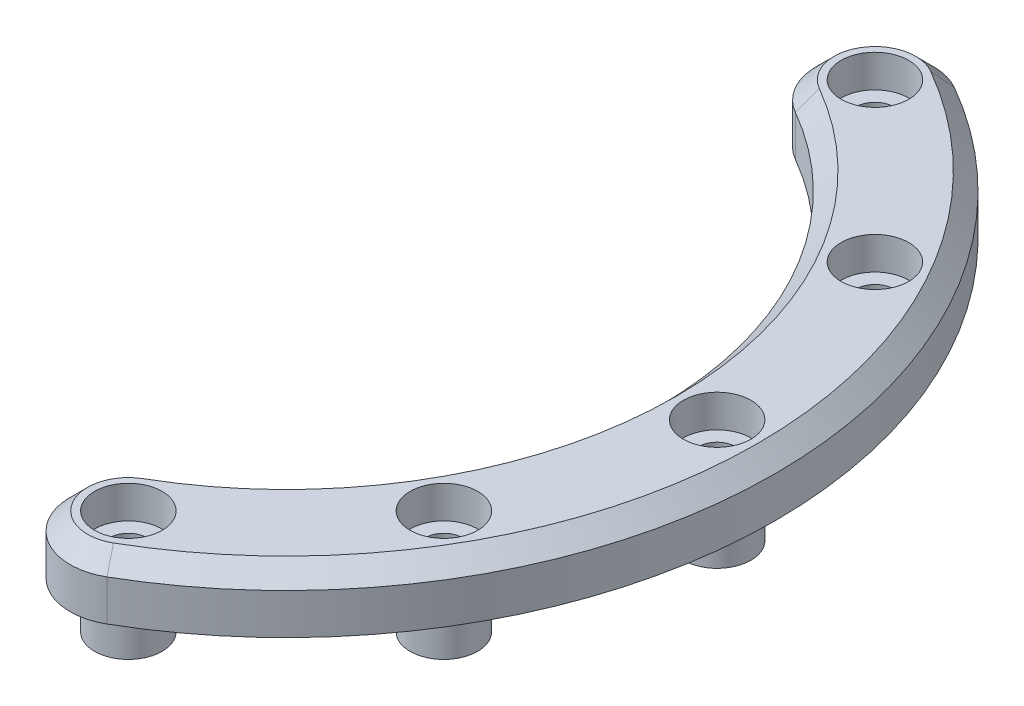
ISO-10303-21;
HEADER;
FILE_DESCRIPTION(('STEP AP214'),'2;1');
FILE_NAME('part.step','',(''),(''),'','','');
FILE_SCHEMA(('AUTOMOTIVE_DESIGN { 1 0 10303 214 1 1 1 1 }'));
ENDSEC;
DATA;
#1=APPLICATION_CONTEXT('core data for automotive mechanical design processes');
#2=APPLICATION_PROTOCOL_DEFINITION('international standard','automotive_design',2000,#1);
#3=PRODUCT_CONTEXT('',#1,'mechanical');
#4=PRODUCT('Part','Part','',(#3));
#5=PRODUCT_RELATED_PRODUCT_CATEGORY('part','',(#4));
#6=PRODUCT_DEFINITION_FORMATION('','',#4);
#7=PRODUCT_DEFINITION_CONTEXT('part definition',#1,'design');
#8=PRODUCT_DEFINITION('design','',#6,#7);
#9=PRODUCT_DEFINITION_SHAPE('','',#8);
#10=(LENGTH_UNIT() NAMED_UNIT(*) SI_UNIT(.MILLI.,.METRE.));
#11=(NAMED_UNIT(*) PLANE_ANGLE_UNIT() SI_UNIT($,.RADIAN.));
#12=(NAMED_UNIT(*) SI_UNIT($,.STERADIAN.) SOLID_ANGLE_UNIT());
#13=UNCERTAINTY_MEASURE_WITH_UNIT(LENGTH_MEASURE(1.E-05),#10,'distance_accuracy_value','');
#14=(GEOMETRIC_REPRESENTATION_CONTEXT(3) GLOBAL_UNCERTAINTY_ASSIGNED_CONTEXT((#13)) GLOBAL_UNIT_ASSIGNED_CONTEXT((#10,
#11,#12)) REPRESENTATION_CONTEXT('',''));
#15=CARTESIAN_POINT('',(0.,0.,0.));
#16=DIRECTION('',(0.,0.,1.));
#17=DIRECTION('',(1.,0.,0.));
#18=AXIS2_PLACEMENT_3D('',#15,#16,#17);
#19=CARTESIAN_POINT('',(18.4999999999999,-4.,-32.0429399400243));
#20=DIRECTION('',(0.,1.,0.));
#21=DIRECTION('',(0.,0.,1.));
#22=AXIS2_PLACEMENT_3D('',#19,#20,#21);
#23=CYLINDRICAL_SURFACE('',#22,1.6);
#24=CARTESIAN_POINT('',(18.4999999999999,-4.,-32.0429399400243));
#25=DIRECTION('',(0.,1.,0.));
#26=DIRECTION('',(0.,0.,1.));
#27=AXIS2_PLACEMENT_3D('',#24,#25,#26);
#28=CIRCLE('',#27,1.6);
#29=CARTESIAN_POINT('',(18.4999999999999,-4.,-30.4429399400243));
#30=VERTEX_POINT('',#29);
#31=EDGE_CURVE('E214',#30,#30,#28,.T.);
#32=ORIENTED_EDGE('',*,*,#31,.F.);
#33=EDGE_LOOP('',(#32));
#34=FACE_BOUND('',#33,.T.);
#35=CARTESIAN_POINT('',(18.4999999999999,2.2,-32.0429399400243));
#36=DIRECTION('',(0.,1.,0.));
#37=DIRECTION('',(0.,0.,1.));
#38=AXIS2_PLACEMENT_3D('',#35,#36,#37);
#39=CIRCLE('',#38,1.6);
#40=CARTESIAN_POINT('',(18.4999999999999,2.2,-30.4429399400243));
#41=VERTEX_POINT('',#40);
#42=EDGE_CURVE('E161',#41,#41,#39,.F.);
#43=ORIENTED_EDGE('',*,*,#42,.F.);
#44=EDGE_LOOP('',(#43));
#45=FACE_BOUND('',#44,.T.);
#46=ADVANCED_FACE('F41',(#34,#45),#23,.F.);
#47=CARTESIAN_POINT('',(32.0429399400251,-4.,-18.5000000000006));
#48=DIRECTION('',(0.,1.,0.));
#49=DIRECTION('',(0.,0.,1.));
#50=AXIS2_PLACEMENT_3D('',#47,#48,#49);
#51=CYLINDRICAL_SURFACE('',#50,1.59999999999923);
#52=CARTESIAN_POINT('',(32.0429399400251,-4.,-18.5000000000006));
#53=DIRECTION('',(0.,1.,0.));
#54=DIRECTION('',(0.,0.,1.));
#55=AXIS2_PLACEMENT_3D('',#52,#53,#54);
#56=CIRCLE('',#55,1.59999999999923);
#57=CARTESIAN_POINT('',(32.0429399400251,-4.,-16.9000000000013));
#58=VERTEX_POINT('',#57);
#59=EDGE_CURVE('E219',#58,#58,#56,.T.);
#60=ORIENTED_EDGE('',*,*,#59,.F.);
#61=EDGE_LOOP('',(#60));
#62=FACE_BOUND('',#61,.T.);
#63=CARTESIAN_POINT('',(32.0429399400251,2.2,-18.5000000000006));
#64=DIRECTION('',(0.,1.,0.));
#65=DIRECTION('',(0.,0.,1.));
#66=AXIS2_PLACEMENT_3D('',#63,#64,#65);
#67=CIRCLE('',#66,1.59999999999923);
#68=CARTESIAN_POINT('',(32.0429399400251,2.2,-16.9000000000013));
#69=VERTEX_POINT('',#68);
#70=EDGE_CURVE('E157',#69,#69,#67,.F.);
#71=ORIENTED_EDGE('',*,*,#70,.F.);
#72=EDGE_LOOP('',(#71));
#73=FACE_BOUND('',#72,.T.);
#74=ADVANCED_FACE('F290',(#62,#73),#51,.F.);
#75=CARTESIAN_POINT('',(37.0000000000018,-4.,-5.07230491538268E-13));
#76=DIRECTION('',(0.,1.,0.));
#77=DIRECTION('',(0.,0.,1.));
#78=AXIS2_PLACEMENT_3D('',#75,#76,#77);
#79=CYLINDRICAL_SURFACE('',#78,1.59999999999902);
#80=CARTESIAN_POINT('',(37.0000000000018,-4.,-5.07230491538268E-13));
#81=DIRECTION('',(0.,1.,0.));
#82=DIRECTION('',(0.,0.,1.));
#83=AXIS2_PLACEMENT_3D('',#80,#81,#82);
#84=CIRCLE('',#83,1.59999999999902);
#85=CARTESIAN_POINT('',(37.0000000000018,-4.,1.59999999999851));
#86=VERTEX_POINT('',#85);
#87=EDGE_CURVE('E223',#86,#86,#84,.T.);
#88=ORIENTED_EDGE('',*,*,#87,.F.);
#89=EDGE_LOOP('',(#88));
#90=FACE_BOUND('',#89,.T.);
#91=CARTESIAN_POINT('',(37.0000000000018,2.2,-5.07230491538268E-13));
#92=DIRECTION('',(0.,1.,0.));
#93=DIRECTION('',(0.,0.,1.));
#94=AXIS2_PLACEMENT_3D('',#91,#92,#93);
#95=CIRCLE('',#94,1.59999999999902);
#96=CARTESIAN_POINT('',(37.0000000000018,2.2,1.59999999999851));
#97=VERTEX_POINT('',#96);
#98=EDGE_CURVE('E153',#97,#97,#95,.F.);
#99=ORIENTED_EDGE('',*,*,#98,.F.);
#100=EDGE_LOOP('',(#99));
#101=FACE_BOUND('',#100,.T.);
#102=ADVANCED_FACE('F296',(#90,#101),#79,.F.);
#103=CARTESIAN_POINT('',(32.0429399400267,-4.,18.5));
#104=DIRECTION('',(0.,1.,0.));
#105=DIRECTION('',(0.,0.,1.));
#106=AXIS2_PLACEMENT_3D('',#103,#104,#105);
#107=CYLINDRICAL_SURFACE('',#106,1.59999999999934);
#108=CARTESIAN_POINT('',(32.0429399400267,-4.,18.5));
#109=DIRECTION('',(0.,1.,0.));
#110=DIRECTION('',(0.,0.,1.));
#111=AXIS2_PLACEMENT_3D('',#108,#109,#110);
#112=CIRCLE('',#111,1.59999999999934);
#113=CARTESIAN_POINT('',(32.0429399400267,-4.,20.0999999999993));
#114=VERTEX_POINT('',#113);
#115=EDGE_CURVE('E227',#114,#114,#112,.T.);
#116=ORIENTED_EDGE('',*,*,#115,.F.);
#117=EDGE_LOOP('',(#116));
#118=FACE_BOUND('',#117,.T.);
#119=CARTESIAN_POINT('',(32.0429399400267,2.2,18.5));
#120=DIRECTION('',(0.,1.,0.));
#121=DIRECTION('',(0.,0.,1.));
#122=AXIS2_PLACEMENT_3D('',#119,#120,#121);
#123=CIRCLE('',#122,1.59999999999934);
#124=CARTESIAN_POINT('',(32.0429399400267,2.2,20.0999999999993));
#125=VERTEX_POINT('',#124);
#126=EDGE_CURVE('E148',#125,#125,#123,.F.);
#127=ORIENTED_EDGE('',*,*,#126,.F.);
#128=EDGE_LOOP('',(#127));
#129=FACE_BOUND('',#128,.T.);
#130=ADVANCED_FACE('F307',(#118,#129),#107,.F.);
#131=CARTESIAN_POINT('',(18.5000000000026,-4.,32.0429399400248));
#132=DIRECTION('',(0.,1.,0.));
#133=DIRECTION('',(0.,0.,1.));
#134=AXIS2_PLACEMENT_3D('',#131,#132,#133);
#135=CYLINDRICAL_SURFACE('',#134,1.60000000000008);
#136=CARTESIAN_POINT('',(18.5000000000026,-4.,32.0429399400248));
#137=DIRECTION('',(0.,1.,0.));
#138=DIRECTION('',(0.,0.,1.));
#139=AXIS2_PLACEMENT_3D('',#136,#137,#138);
#140=CIRCLE('',#139,1.60000000000008);
#141=CARTESIAN_POINT('',(18.5000000000026,-4.,33.6429399400249));
#142=VERTEX_POINT('',#141);
#143=EDGE_CURVE('E165',#142,#142,#140,.T.);
#144=ORIENTED_EDGE('',*,*,#143,.F.);
#145=EDGE_LOOP('',(#144));
#146=FACE_BOUND('',#145,.T.);
#147=CARTESIAN_POINT('',(18.5000000000026,2.2,32.0429399400248));
#148=DIRECTION('',(0.,1.,0.));
#149=DIRECTION('',(0.,0.,1.));
#150=AXIS2_PLACEMENT_3D('',#147,#148,#149);
#151=CIRCLE('',#150,1.60000000000008);
#152=CARTESIAN_POINT('',(18.5000000000026,2.2,33.6429399400249));
#153=VERTEX_POINT('',#152);
#154=EDGE_CURVE('E144',#153,#153,#151,.F.);
#155=ORIENTED_EDGE('',*,*,#154,.F.);
#156=EDGE_LOOP('',(#155));
#157=FACE_BOUND('',#156,.T.);
#158=ADVANCED_FACE('F311',(#146,#157),#135,.F.);
#159=CARTESIAN_POINT('',(0.,5.,0.));
#160=DIRECTION('',(0.,-1.,0.));
#161=DIRECTION('',(0.,0.,-1.));
#162=AXIS2_PLACEMENT_3D('',#159,#160,#161);
#163=CYLINDRICAL_SURFACE('',#162,32.);
#164=DIRECTION('',(0.,-1.,0.));
#165=VECTOR('',#164,1.);
#166=CARTESIAN_POINT('',(15.9999999999999,5.,27.7128129211021));
#167=LINE('',#166,#165);
#168=CARTESIAN_POINT('',(15.9999999999999,3.49999999999999,27.7128129211021));
#169=VERTEX_POINT('',#168);
#170=CARTESIAN_POINT('',(15.9999999999999,0.,27.7128129211021));
#171=VERTEX_POINT('',#170);
#172=EDGE_CURVE('E96',#169,#171,#167,.T.);
#173=ORIENTED_EDGE('',*,*,#172,.F.);
#174=CARTESIAN_POINT('',(0.,3.49999999999999,0.));
#175=DIRECTION('',(0.,-1.,0.));
#176=DIRECTION('',(0.,0.,-1.));
#177=AXIS2_PLACEMENT_3D('',#174,#175,#176);
#178=CIRCLE('',#177,32.);
#179=CARTESIAN_POINT('',(15.9999999999999,3.49999999999999,-27.7128129211021));
#180=VERTEX_POINT('',#179);
#181=EDGE_CURVE('E178',#169,#180,#178,.F.);
#182=ORIENTED_EDGE('',*,*,#181,.T.);
#183=DIRECTION('',(0.,-1.,0.));
#184=VECTOR('',#183,1.);
#185=CARTESIAN_POINT('',(15.9999999999999,5.,-27.7128129211021));
#186=LINE('',#185,#184);
#187=CARTESIAN_POINT('',(15.9999999999999,0.,-27.7128129211021));
#188=VERTEX_POINT('',#187);
#189=EDGE_CURVE('E121',#180,#188,#186,.T.);
#190=ORIENTED_EDGE('',*,*,#189,.T.);
#191=CARTESIAN_POINT('',(0.,0.,0.));
#192=DIRECTION('',(0.,-1.,0.));
#193=DIRECTION('',(0.,0.,-1.));
#194=AXIS2_PLACEMENT_3D('',#191,#192,#193);
#195=CIRCLE('',#194,32.);
#196=EDGE_CURVE('E115',#188,#171,#195,.T.);
#197=ORIENTED_EDGE('',*,*,#196,.T.);
#198=EDGE_LOOP('',(#173,#182,#190,#197));
#199=FACE_BOUND('',#198,.T.);
#200=ADVANCED_FACE('F120',(#199),#163,.F.);
#201=CARTESIAN_POINT('',(18.4999999999999,5.,32.0429399400243));
#202=DIRECTION('',(0.,-1.,0.));
#203=DIRECTION('',(0.,0.,-1.));
#204=AXIS2_PLACEMENT_3D('',#201,#202,#203);
#205=CYLINDRICAL_SURFACE('',#204,5.);
#206=DIRECTION('',(0.,-1.,0.));
#207=VECTOR('',#206,1.);
#208=CARTESIAN_POINT('',(20.9999999999999,5.,36.3730669589465));
#209=LINE('',#208,#207);
#210=CARTESIAN_POINT('',(20.9999999999999,3.49999999999999,36.3730669589465));
#211=VERTEX_POINT('',#210);
#212=CARTESIAN_POINT('',(20.9999999999999,0.,36.3730669589465));
#213=VERTEX_POINT('',#212);
#214=EDGE_CURVE('E109',#211,#213,#209,.T.);
#215=ORIENTED_EDGE('',*,*,#214,.F.);
#216=CARTESIAN_POINT('',(18.4999999999999,3.49999999999999,32.0429399400243));
#217=DIRECTION('',(0.,-1.,0.));
#218=DIRECTION('',(0.,0.,-1.));
#219=AXIS2_PLACEMENT_3D('',#216,#217,#218);
#220=CIRCLE('',#219,5.);
#221=EDGE_CURVE('E102',#211,#169,#220,.T.);
#222=ORIENTED_EDGE('',*,*,#221,.T.);
#223=ORIENTED_EDGE('',*,*,#172,.T.);
#224=CARTESIAN_POINT('',(18.4999999999999,0.,32.0429399400243));
#225=DIRECTION('',(0.,1.,0.));
#226=DIRECTION('',(0.,0.,-1.));
#227=AXIS2_PLACEMENT_3D('',#224,#225,#226);
#228=CIRCLE('',#227,5.);
#229=EDGE_CURVE('E99',#171,#213,#228,.T.);
#230=ORIENTED_EDGE('',*,*,#229,.T.);
#231=EDGE_LOOP('',(#215,#222,#223,#230));
#232=FACE_BOUND('',#231,.T.);
#233=ADVANCED_FACE('F98',(#232),#205,.T.);
#234=CARTESIAN_POINT('',(0.,5.,0.));
#235=DIRECTION('',(0.,-1.,0.));
#236=DIRECTION('',(0.,0.,-1.));
#237=AXIS2_PLACEMENT_3D('',#234,#235,#236);
#238=CYLINDRICAL_SURFACE('',#237,42.);
#239=DIRECTION('',(0.,-1.,0.));
#240=VECTOR('',#239,1.);
#241=CARTESIAN_POINT('',(20.9999999999999,5.,-36.3730669589465));
#242=LINE('',#241,#240);
#243=CARTESIAN_POINT('',(20.9999999999999,3.49999999999999,-36.3730669589465));
#244=VERTEX_POINT('',#243);
#245=CARTESIAN_POINT('',(20.9999999999999,0.,-36.3730669589465));
#246=VERTEX_POINT('',#245);
#247=EDGE_CURVE('E139',#244,#246,#242,.T.);
#248=ORIENTED_EDGE('',*,*,#247,.F.);
#249=CARTESIAN_POINT('',(0.,3.49999999999999,0.));
#250=DIRECTION('',(0.,-1.,0.));
#251=DIRECTION('',(0.,0.,-1.));
#252=AXIS2_PLACEMENT_3D('',#249,#250,#251);
#253=CIRCLE('',#252,42.);
#254=EDGE_CURVE('E11',#244,#211,#253,.T.);
#255=ORIENTED_EDGE('',*,*,#254,.T.);
#256=ORIENTED_EDGE('',*,*,#214,.T.);
#257=CARTESIAN_POINT('',(0.,0.,0.));
#258=DIRECTION('',(0.,1.,0.));
#259=DIRECTION('',(0.,0.,-1.));
#260=AXIS2_PLACEMENT_3D('',#257,#258,#259);
#261=CIRCLE('',#260,42.);
#262=EDGE_CURVE('E117',#213,#246,#261,.T.);
#263=ORIENTED_EDGE('',*,*,#262,.T.);
#264=EDGE_LOOP('',(#248,#255,#256,#263));
#265=FACE_BOUND('',#264,.T.);
#266=ADVANCED_FACE('F582',(#265),#238,.T.);
#267=CARTESIAN_POINT('',(18.4999999999999,5.,-32.0429399400243));
#268=DIRECTION('',(0.,-1.,0.));
#269=DIRECTION('',(0.,0.,-1.));
#270=AXIS2_PLACEMENT_3D('',#267,#268,#269);
#271=CYLINDRICAL_SURFACE('',#270,5.);
#272=ORIENTED_EDGE('',*,*,#189,.F.);
#273=CARTESIAN_POINT('',(18.4999999999999,3.49999999999999,-32.0429399400243));
#274=DIRECTION('',(0.,-1.,0.));
#275=DIRECTION('',(0.,0.,-1.));
#276=AXIS2_PLACEMENT_3D('',#273,#274,#275);
#277=CIRCLE('',#276,5.);
#278=EDGE_CURVE('E52',#180,#244,#277,.T.);
#279=ORIENTED_EDGE('',*,*,#278,.T.);
#280=ORIENTED_EDGE('',*,*,#247,.T.);
#281=CARTESIAN_POINT('',(18.4999999999999,0.,-32.0429399400243));
#282=DIRECTION('',(0.,1.,0.));
#283=DIRECTION('',(0.,0.,1.));
#284=AXIS2_PLACEMENT_3D('',#281,#282,#283);
#285=CIRCLE('',#284,5.);
#286=EDGE_CURVE('E134',#246,#188,#285,.T.);
#287=ORIENTED_EDGE('',*,*,#286,.T.);
#288=EDGE_LOOP('',(#272,#279,#280,#287));
#289=FACE_BOUND('',#288,.T.);
#290=ADVANCED_FACE('F574',(#289),#271,.T.);
#291=CARTESIAN_POINT('',(9.24999999999996,5.,16.0214699700121));
#292=DIRECTION('',(0.,-1.,0.));
#293=DIRECTION('',(0.,0.,-1.));
#294=AXIS2_PLACEMENT_3D('',#291,#292,#293);
#295=PLANE('',#294);
#296=CARTESIAN_POINT('',(18.4999999999999,5.,-32.0429399400243));
#297=DIRECTION('',(0.,-1.,0.));
#298=DIRECTION('',(0.,0.,-1.));
#299=AXIS2_PLACEMENT_3D('',#296,#297,#298);
#300=CIRCLE('',#299,3.5);
#301=CARTESIAN_POINT('',(20.2499999999999,5.,-35.0740288532698));
#302=VERTEX_POINT('',#301);
#303=CARTESIAN_POINT('',(16.7499999999999,5.,-29.0118510267787));
#304=VERTEX_POINT('',#303);
#305=EDGE_CURVE('E168',#302,#304,#300,.F.);
#306=ORIENTED_EDGE('',*,*,#305,.T.);
#307=CARTESIAN_POINT('',(0.,5.,0.));
#308=DIRECTION('',(0.,-1.,0.));
#309=DIRECTION('',(0.,0.,-1.));
#310=AXIS2_PLACEMENT_3D('',#307,#308,#309);
#311=CIRCLE('',#310,33.5);
#312=CARTESIAN_POINT('',(16.7499999999999,5.,29.0118510267787));
#313=VERTEX_POINT('',#312);
#314=EDGE_CURVE('E174',#304,#313,#311,.T.);
#315=ORIENTED_EDGE('',*,*,#314,.T.);
#316=CARTESIAN_POINT('',(18.4999999999999,5.,32.0429399400243));
#317=DIRECTION('',(0.,-1.,0.));
#318=DIRECTION('',(0.,0.,-1.));
#319=AXIS2_PLACEMENT_3D('',#316,#317,#318);
#320=CIRCLE('',#319,3.5);
#321=CARTESIAN_POINT('',(20.2499999999999,5.,35.0740288532698));
#322=VERTEX_POINT('',#321);
#323=EDGE_CURVE('E171',#313,#322,#320,.F.);
#324=ORIENTED_EDGE('',*,*,#323,.T.);
#325=CARTESIAN_POINT('',(0.,5.,0.));
#326=DIRECTION('',(0.,-1.,0.));
#327=DIRECTION('',(0.,0.,-1.));
#328=AXIS2_PLACEMENT_3D('',#325,#326,#327);
#329=CIRCLE('',#328,40.5);
#330=EDGE_CURVE('E108',#322,#302,#329,.F.);
#331=ORIENTED_EDGE('',*,*,#330,.T.);
#332=EDGE_LOOP('',(#306,#315,#324,#331));
#333=FACE_BOUND('',#332,.T.);
#334=CARTESIAN_POINT('',(18.4999999999999,5.,-32.0429399400243));
#335=DIRECTION('',(0.,1.,0.));
#336=DIRECTION('',(0.,0.,1.));
#337=AXIS2_PLACEMENT_3D('',#334,#335,#336);
#338=CIRCLE('',#337,2.9);
#339=CARTESIAN_POINT('',(18.4999999999999,5.,-29.1429399400243));
#340=VERTEX_POINT('',#339);
#341=EDGE_CURVE('E633',#340,#340,#338,.T.);
#342=ORIENTED_EDGE('',*,*,#341,.F.);
#343=EDGE_LOOP('',(#342));
#344=FACE_BOUND('',#343,.T.);
#345=CARTESIAN_POINT('',(32.0429399400251,5.,-18.5000000000006));
#346=DIRECTION('',(0.,1.,0.));
#347=DIRECTION('',(0.,0.,1.));
#348=AXIS2_PLACEMENT_3D('',#345,#346,#347);
#349=CIRCLE('',#348,2.89999999999923);
#350=CARTESIAN_POINT('',(32.0429399400251,5.,-15.6000000000013));
#351=VERTEX_POINT('',#350);
#352=EDGE_CURVE('E637',#351,#351,#349,.T.);
#353=ORIENTED_EDGE('',*,*,#352,.F.);
#354=EDGE_LOOP('',(#353));
#355=FACE_BOUND('',#354,.T.);
#356=CARTESIAN_POINT('',(37.0000000000018,5.,-5.07230491538268E-13));
#357=DIRECTION('',(0.,1.,0.));
#358=DIRECTION('',(0.,0.,1.));
#359=AXIS2_PLACEMENT_3D('',#356,#357,#358);
#360=CIRCLE('',#359,2.89999999999902);
#361=CARTESIAN_POINT('',(37.0000000000018,5.,2.89999999999851));
#362=VERTEX_POINT('',#361);
#363=EDGE_CURVE('E641',#362,#362,#360,.T.);
#364=ORIENTED_EDGE('',*,*,#363,.F.);
#365=EDGE_LOOP('',(#364));
#366=FACE_BOUND('',#365,.T.);
#367=CARTESIAN_POINT('',(32.0429399400267,5.,18.5));
#368=DIRECTION('',(0.,1.,0.));
#369=DIRECTION('',(0.,0.,1.));
#370=AXIS2_PLACEMENT_3D('',#367,#368,#369);
#371=CIRCLE('',#370,2.89999999999934);
#372=CARTESIAN_POINT('',(32.0429399400267,5.,21.3999999999993));
#373=VERTEX_POINT('',#372);
#374=EDGE_CURVE('E210',#373,#373,#371,.T.);
#375=ORIENTED_EDGE('',*,*,#374,.F.);
#376=EDGE_LOOP('',(#375));
#377=FACE_BOUND('',#376,.T.);
#378=CARTESIAN_POINT('',(18.5000000000026,5.,32.0429399400248));
#379=DIRECTION('',(0.,1.,0.));
#380=DIRECTION('',(0.,0.,1.));
#381=AXIS2_PLACEMENT_3D('',#378,#379,#380);
#382=CIRCLE('',#381,2.90000000000008);
#383=CARTESIAN_POINT('',(18.5000000000026,5.,34.9429399400249));
#384=VERTEX_POINT('',#383);
#385=EDGE_CURVE('E198',#384,#384,#382,.T.);
#386=ORIENTED_EDGE('',*,*,#385,.F.);
#387=EDGE_LOOP('',(#386));
#388=FACE_BOUND('',#387,.T.);
#389=ADVANCED_FACE('F271',(#333,#344,#355,#366,#377,#388),#295,.F.);
#390=CARTESIAN_POINT('',(9.24999999999996,0.,16.0214699700121));
#391=DIRECTION('',(0.,-1.,0.));
#392=DIRECTION('',(0.,0.,-1.));
#393=AXIS2_PLACEMENT_3D('',#390,#391,#392);
#394=PLANE('',#393);
#395=CARTESIAN_POINT('',(18.5000000000026,0.,-32.0429399400248));
#396=DIRECTION('',(0.,-1.,0.));
#397=DIRECTION('',(0.,0.,-1.));
#398=AXIS2_PLACEMENT_3D('',#395,#396,#397);
#399=CIRCLE('',#398,2.9);
#400=CARTESIAN_POINT('',(18.5000000000026,0.,-34.9429399400248));
#401=VERTEX_POINT('',#400);
#402=EDGE_CURVE('E218',#401,#401,#399,.T.);
#403=ORIENTED_EDGE('',*,*,#402,.F.);
#404=EDGE_LOOP('',(#403));
#405=FACE_BOUND('',#404,.T.);
#406=CARTESIAN_POINT('',(32.0429399400267,0.,-18.5));
#407=DIRECTION('',(0.,-1.,0.));
#408=DIRECTION('',(0.,0.,-1.));
#409=AXIS2_PLACEMENT_3D('',#406,#407,#408);
#410=CIRCLE('',#409,2.9);
#411=CARTESIAN_POINT('',(32.0429399400267,0.,-21.4));
#412=VERTEX_POINT('',#411);
#413=EDGE_CURVE('E238',#412,#412,#410,.T.);
#414=ORIENTED_EDGE('',*,*,#413,.F.);
#415=EDGE_LOOP('',(#414));
#416=FACE_BOUND('',#415,.T.);
#417=CARTESIAN_POINT('',(37.0000000000018,0.,5.07230491538268E-13));
#418=DIRECTION('',(0.,-1.,0.));
#419=DIRECTION('',(0.,0.,-1.));
#420=AXIS2_PLACEMENT_3D('',#417,#418,#419);
#421=CIRCLE('',#420,2.9);
#422=CARTESIAN_POINT('',(37.0000000000018,0.,-2.89999999999949));
#423=VERTEX_POINT('',#422);
#424=EDGE_CURVE('E246',#423,#423,#421,.T.);
#425=ORIENTED_EDGE('',*,*,#424,.F.);
#426=EDGE_LOOP('',(#425));
#427=FACE_BOUND('',#426,.T.);
#428=CARTESIAN_POINT('',(32.0429399400251,0.,18.5000000000006));
#429=DIRECTION('',(0.,-1.,0.));
#430=DIRECTION('',(0.,0.,-1.));
#431=AXIS2_PLACEMENT_3D('',#428,#429,#430);
#432=CIRCLE('',#431,2.9);
#433=CARTESIAN_POINT('',(32.0429399400251,0.,15.6000000000006));
#434=VERTEX_POINT('',#433);
#435=EDGE_CURVE('E254',#434,#434,#432,.T.);
#436=ORIENTED_EDGE('',*,*,#435,.F.);
#437=EDGE_LOOP('',(#436));
#438=FACE_BOUND('',#437,.T.);
#439=CARTESIAN_POINT('',(18.4999999999999,0.,32.0429399400243));
#440=DIRECTION('',(0.,-1.,0.));
#441=DIRECTION('',(0.,0.,-1.));
#442=AXIS2_PLACEMENT_3D('',#439,#440,#441);
#443=CIRCLE('',#442,2.9);
#444=CARTESIAN_POINT('',(18.4999999999999,0.,29.1429399400243));
#445=VERTEX_POINT('',#444);
#446=EDGE_CURVE('E128',#445,#445,#443,.T.);
#447=ORIENTED_EDGE('',*,*,#446,.F.);
#448=EDGE_LOOP('',(#447));
#449=FACE_BOUND('',#448,.T.);
#450=ORIENTED_EDGE('',*,*,#196,.F.);
#451=ORIENTED_EDGE('',*,*,#286,.F.);
#452=ORIENTED_EDGE('',*,*,#262,.F.);
#453=ORIENTED_EDGE('',*,*,#229,.F.);
#454=EDGE_LOOP('',(#450,#451,#452,#453));
#455=FACE_BOUND('',#454,.T.);
#456=ADVANCED_FACE('F113',(#405,#416,#427,#438,#449,#455),#394,.T.);
#457=CARTESIAN_POINT('',(18.4999999999999,-4.,32.0429399400243));
#458=DIRECTION('',(0.,1.,0.));
#459=DIRECTION('',(0.,0.,1.));
#460=AXIS2_PLACEMENT_3D('',#457,#458,#459);
#461=CYLINDRICAL_SURFACE('',#460,2.9);
#462=CARTESIAN_POINT('',(18.4999999999999,-4.,32.0429399400243));
#463=DIRECTION('',(0.,-1.,0.));
#464=DIRECTION('',(0.,0.,-1.));
#465=AXIS2_PLACEMENT_3D('',#462,#463,#464);
#466=CIRCLE('',#465,2.9);
#467=CARTESIAN_POINT('',(18.4999999999999,-4.,29.1429399400243));
#468=VERTEX_POINT('',#467);
#469=EDGE_CURVE('E124',#468,#468,#466,.T.);
#470=ORIENTED_EDGE('',*,*,#469,.F.);
#471=EDGE_LOOP('',(#470));
#472=FACE_BOUND('',#471,.T.);
#473=ORIENTED_EDGE('',*,*,#446,.T.);
#474=EDGE_LOOP('',(#473));
#475=FACE_BOUND('',#474,.T.);
#476=ADVANCED_FACE('F270',(#472,#475),#461,.T.);
#477=CARTESIAN_POINT('',(18.4999999999999,-4.,32.0429399400243));
#478=DIRECTION('',(0.,-1.,0.));
#479=DIRECTION('',(0.,0.,-1.));
#480=AXIS2_PLACEMENT_3D('',#477,#478,#479);
#481=PLANE('',#480);
#482=ORIENTED_EDGE('',*,*,#143,.T.);
#483=EDGE_LOOP('',(#482));
#484=FACE_BOUND('',#483,.T.);
#485=ORIENTED_EDGE('',*,*,#469,.T.);
#486=EDGE_LOOP('',(#485));
#487=FACE_BOUND('',#486,.T.);
#488=ADVANCED_FACE('F279',(#484,#487),#481,.T.);
#489=CARTESIAN_POINT('',(32.0429399400251,-4.,18.5000000000006));
#490=DIRECTION('',(0.,1.,0.));
#491=DIRECTION('',(0.,0.,1.));
#492=AXIS2_PLACEMENT_3D('',#489,#490,#491);
#493=CYLINDRICAL_SURFACE('',#492,2.9);
#494=CARTESIAN_POINT('',(32.0429399400251,-4.,18.5000000000006));
#495=DIRECTION('',(0.,-1.,0.));
#496=DIRECTION('',(0.,0.,-1.));
#497=AXIS2_PLACEMENT_3D('',#494,#495,#496);
#498=CIRCLE('',#497,2.9);
#499=CARTESIAN_POINT('',(32.0429399400251,-4.,15.6000000000006));
#500=VERTEX_POINT('',#499);
#501=EDGE_CURVE('E258',#500,#500,#498,.T.);
#502=ORIENTED_EDGE('',*,*,#501,.F.);
#503=EDGE_LOOP('',(#502));
#504=FACE_BOUND('',#503,.T.);
#505=ORIENTED_EDGE('',*,*,#435,.T.);
#506=EDGE_LOOP('',(#505));
#507=FACE_BOUND('',#506,.T.);
#508=ADVANCED_FACE('F266',(#504,#507),#493,.T.);
#509=CARTESIAN_POINT('',(32.0429399400251,-4.,18.5000000000006));
#510=DIRECTION('',(0.,-1.,0.));
#511=DIRECTION('',(0.,0.,-1.));
#512=AXIS2_PLACEMENT_3D('',#509,#510,#511);
#513=PLANE('',#512);
#514=ORIENTED_EDGE('',*,*,#115,.T.);
#515=EDGE_LOOP('',(#514));
#516=FACE_BOUND('',#515,.T.);
#517=ORIENTED_EDGE('',*,*,#501,.T.);
#518=EDGE_LOOP('',(#517));
#519=FACE_BOUND('',#518,.T.);
#520=ADVANCED_FACE('F340',(#516,#519),#513,.T.);
#521=CARTESIAN_POINT('',(37.0000000000018,-4.,5.07230491538268E-13));
#522=DIRECTION('',(0.,1.,0.));
#523=DIRECTION('',(0.,0.,1.));
#524=AXIS2_PLACEMENT_3D('',#521,#522,#523);
#525=CYLINDRICAL_SURFACE('',#524,2.9);
#526=CARTESIAN_POINT('',(37.0000000000018,-4.,5.07230491538268E-13));
#527=DIRECTION('',(0.,-1.,0.));
#528=DIRECTION('',(0.,0.,-1.));
#529=AXIS2_PLACEMENT_3D('',#526,#527,#528);
#530=CIRCLE('',#529,2.9);
#531=CARTESIAN_POINT('',(37.0000000000018,-4.,-2.89999999999949));
#532=VERTEX_POINT('',#531);
#533=EDGE_CURVE('E250',#532,#532,#530,.T.);
#534=ORIENTED_EDGE('',*,*,#533,.F.);
#535=EDGE_LOOP('',(#534));
#536=FACE_BOUND('',#535,.T.);
#537=ORIENTED_EDGE('',*,*,#424,.T.);
#538=EDGE_LOOP('',(#537));
#539=FACE_BOUND('',#538,.T.);
#540=ADVANCED_FACE('F336',(#536,#539),#525,.T.);
#541=CARTESIAN_POINT('',(37.0000000000018,-4.,5.07230491538268E-13));
#542=DIRECTION('',(0.,-1.,0.));
#543=DIRECTION('',(0.,0.,-1.));
#544=AXIS2_PLACEMENT_3D('',#541,#542,#543);
#545=PLANE('',#544);
#546=ORIENTED_EDGE('',*,*,#87,.T.);
#547=EDGE_LOOP('',(#546));
#548=FACE_BOUND('',#547,.T.);
#549=ORIENTED_EDGE('',*,*,#533,.T.);
#550=EDGE_LOOP('',(#549));
#551=FACE_BOUND('',#550,.T.);
#552=ADVANCED_FACE('F332',(#548,#551),#545,.T.);
#553=CARTESIAN_POINT('',(32.0429399400267,-4.,-18.5));
#554=DIRECTION('',(0.,1.,0.));
#555=DIRECTION('',(0.,0.,1.));
#556=AXIS2_PLACEMENT_3D('',#553,#554,#555);
#557=CYLINDRICAL_SURFACE('',#556,2.9);
#558=CARTESIAN_POINT('',(32.0429399400267,-4.,-18.5));
#559=DIRECTION('',(0.,-1.,0.));
#560=DIRECTION('',(0.,0.,-1.));
#561=AXIS2_PLACEMENT_3D('',#558,#559,#560);
#562=CIRCLE('',#561,2.9);
#563=CARTESIAN_POINT('',(32.0429399400267,-4.,-21.4));
#564=VERTEX_POINT('',#563);
#565=EDGE_CURVE('E242',#564,#564,#562,.T.);
#566=ORIENTED_EDGE('',*,*,#565,.F.);
#567=EDGE_LOOP('',(#566));
#568=FACE_BOUND('',#567,.T.);
#569=ORIENTED_EDGE('',*,*,#413,.T.);
#570=EDGE_LOOP('',(#569));
#571=FACE_BOUND('',#570,.T.);
#572=ADVANCED_FACE('F328',(#568,#571),#557,.T.);
#573=CARTESIAN_POINT('',(32.0429399400267,-4.,-18.5));
#574=DIRECTION('',(0.,-1.,0.));
#575=DIRECTION('',(0.,0.,-1.));
#576=AXIS2_PLACEMENT_3D('',#573,#574,#575);
#577=PLANE('',#576);
#578=ORIENTED_EDGE('',*,*,#59,.T.);
#579=EDGE_LOOP('',(#578));
#580=FACE_BOUND('',#579,.T.);
#581=ORIENTED_EDGE('',*,*,#565,.T.);
#582=EDGE_LOOP('',(#581));
#583=FACE_BOUND('',#582,.T.);
#584=ADVANCED_FACE('F324',(#580,#583),#577,.T.);
#585=CARTESIAN_POINT('',(18.5000000000026,-4.,-32.0429399400248));
#586=DIRECTION('',(0.,1.,0.));
#587=DIRECTION('',(0.,0.,1.));
#588=AXIS2_PLACEMENT_3D('',#585,#586,#587);
#589=CYLINDRICAL_SURFACE('',#588,2.9);
#590=CARTESIAN_POINT('',(18.5000000000026,-4.,-32.0429399400248));
#591=DIRECTION('',(0.,-1.,0.));
#592=DIRECTION('',(0.,0.,-1.));
#593=AXIS2_PLACEMENT_3D('',#590,#591,#592);
#594=CIRCLE('',#593,2.9);
#595=CARTESIAN_POINT('',(18.5000000000026,-4.,-34.9429399400248));
#596=VERTEX_POINT('',#595);
#597=EDGE_CURVE('E234',#596,#596,#594,.T.);
#598=ORIENTED_EDGE('',*,*,#597,.F.);
#599=EDGE_LOOP('',(#598));
#600=FACE_BOUND('',#599,.T.);
#601=ORIENTED_EDGE('',*,*,#402,.T.);
#602=EDGE_LOOP('',(#601));
#603=FACE_BOUND('',#602,.T.);
#604=ADVANCED_FACE('F320',(#600,#603),#589,.T.);
#605=CARTESIAN_POINT('',(18.5000000000026,-4.,-32.0429399400248));
#606=DIRECTION('',(0.,-1.,0.));
#607=DIRECTION('',(0.,0.,-1.));
#608=AXIS2_PLACEMENT_3D('',#605,#606,#607);
#609=PLANE('',#608);
#610=ORIENTED_EDGE('',*,*,#31,.T.);
#611=EDGE_LOOP('',(#610));
#612=FACE_BOUND('',#611,.T.);
#613=ORIENTED_EDGE('',*,*,#597,.T.);
#614=EDGE_LOOP('',(#613));
#615=FACE_BOUND('',#614,.T.);
#616=ADVANCED_FACE('F316',(#612,#615),#609,.T.);
#617=CARTESIAN_POINT('',(18.5000000000026,2.2,32.0429399400248));
#618=DIRECTION('',(0.,1.,0.));
#619=DIRECTION('',(0.,0.,1.));
#620=AXIS2_PLACEMENT_3D('',#617,#618,#619);
#621=PLANE('',#620);
#622=CARTESIAN_POINT('',(18.5000000000026,2.2,32.0429399400248));
#623=DIRECTION('',(0.,1.,0.));
#624=DIRECTION('',(0.,0.,1.));
#625=AXIS2_PLACEMENT_3D('',#622,#623,#624);
#626=CIRCLE('',#625,2.90000000000008);
#627=CARTESIAN_POINT('',(18.5000000000026,2.2,34.9429399400249));
#628=VERTEX_POINT('',#627);
#629=EDGE_CURVE('E204',#628,#628,#626,.T.);
#630=ORIENTED_EDGE('',*,*,#629,.T.);
#631=EDGE_LOOP('',(#630));
#632=FACE_BOUND('',#631,.T.);
#633=ORIENTED_EDGE('',*,*,#154,.T.);
#634=EDGE_LOOP('',(#633));
#635=FACE_BOUND('',#634,.T.);
#636=ADVANCED_FACE('F319',(#632,#635),#621,.T.);
#637=CARTESIAN_POINT('',(18.5000000000026,2.2,32.0429399400248));
#638=DIRECTION('',(0.,1.,0.));
#639=DIRECTION('',(0.,0.,1.));
#640=AXIS2_PLACEMENT_3D('',#637,#638,#639);
#641=CYLINDRICAL_SURFACE('',#640,2.90000000000008);
#642=ORIENTED_EDGE('',*,*,#629,.F.);
#643=EDGE_LOOP('',(#642));
#644=FACE_BOUND('',#643,.T.);
#645=ORIENTED_EDGE('',*,*,#385,.T.);
#646=EDGE_LOOP('',(#645));
#647=FACE_BOUND('',#646,.T.);
#648=ADVANCED_FACE('F302',(#644,#647),#641,.F.);
#649=CARTESIAN_POINT('',(32.0429399400267,2.2,18.5));
#650=DIRECTION('',(0.,1.,0.));
#651=DIRECTION('',(0.,0.,1.));
#652=AXIS2_PLACEMENT_3D('',#649,#650,#651);
#653=PLANE('',#652);
#654=CARTESIAN_POINT('',(32.0429399400267,2.2,18.5));
#655=DIRECTION('',(0.,1.,0.));
#656=DIRECTION('',(0.,0.,1.));
#657=AXIS2_PLACEMENT_3D('',#654,#655,#656);
#658=CIRCLE('',#657,2.89999999999934);
#659=CARTESIAN_POINT('',(32.0429399400267,2.2,21.3999999999993));
#660=VERTEX_POINT('',#659);
#661=EDGE_CURVE('E647',#660,#660,#658,.T.);
#662=ORIENTED_EDGE('',*,*,#661,.T.);
#663=EDGE_LOOP('',(#662));
#664=FACE_BOUND('',#663,.T.);
#665=ORIENTED_EDGE('',*,*,#126,.T.);
#666=EDGE_LOOP('',(#665));
#667=FACE_BOUND('',#666,.T.);
#668=ADVANCED_FACE('F394',(#664,#667),#653,.T.);
#669=CARTESIAN_POINT('',(32.0429399400267,2.2,18.5));
#670=DIRECTION('',(0.,1.,0.));
#671=DIRECTION('',(0.,0.,1.));
#672=AXIS2_PLACEMENT_3D('',#669,#670,#671);
#673=CYLINDRICAL_SURFACE('',#672,2.89999999999934);
#674=ORIENTED_EDGE('',*,*,#661,.F.);
#675=EDGE_LOOP('',(#674));
#676=FACE_BOUND('',#675,.T.);
#677=ORIENTED_EDGE('',*,*,#374,.T.);
#678=EDGE_LOOP('',(#677));
#679=FACE_BOUND('',#678,.T.);
#680=ADVANCED_FACE('F401',(#676,#679),#673,.F.);
#681=CARTESIAN_POINT('',(37.0000000000018,2.2,-5.07230491538268E-13));
#682=DIRECTION('',(0.,1.,0.));
#683=DIRECTION('',(0.,0.,1.));
#684=AXIS2_PLACEMENT_3D('',#681,#682,#683);
#685=PLANE('',#684);
#686=CARTESIAN_POINT('',(37.0000000000018,2.2,-5.07230491538268E-13));
#687=DIRECTION('',(0.,1.,0.));
#688=DIRECTION('',(0.,0.,1.));
#689=AXIS2_PLACEMENT_3D('',#686,#687,#688);
#690=CIRCLE('',#689,2.89999999999902);
#691=CARTESIAN_POINT('',(37.0000000000018,2.2,2.89999999999851));
#692=VERTEX_POINT('',#691);
#693=EDGE_CURVE('E654',#692,#692,#690,.T.);
#694=ORIENTED_EDGE('',*,*,#693,.T.);
#695=EDGE_LOOP('',(#694));
#696=FACE_BOUND('',#695,.T.);
#697=ORIENTED_EDGE('',*,*,#98,.T.);
#698=EDGE_LOOP('',(#697));
#699=FACE_BOUND('',#698,.T.);
#700=ADVANCED_FACE('F409',(#696,#699),#685,.T.);
#701=CARTESIAN_POINT('',(37.0000000000018,2.2,-5.07230491538268E-13));
#702=DIRECTION('',(0.,1.,0.));
#703=DIRECTION('',(0.,0.,1.));
#704=AXIS2_PLACEMENT_3D('',#701,#702,#703);
#705=CYLINDRICAL_SURFACE('',#704,2.89999999999902);
#706=ORIENTED_EDGE('',*,*,#693,.F.);
#707=EDGE_LOOP('',(#706));
#708=FACE_BOUND('',#707,.T.);
#709=ORIENTED_EDGE('',*,*,#363,.T.);
#710=EDGE_LOOP('',(#709));
#711=FACE_BOUND('',#710,.T.);
#712=ADVANCED_FACE('F417',(#708,#711),#705,.F.);
#713=CARTESIAN_POINT('',(32.0429399400251,2.2,-18.5000000000006));
#714=DIRECTION('',(0.,1.,0.));
#715=DIRECTION('',(0.,0.,1.));
#716=AXIS2_PLACEMENT_3D('',#713,#714,#715);
#717=PLANE('',#716);
#718=CARTESIAN_POINT('',(32.0429399400251,2.2,-18.5000000000006));
#719=DIRECTION('',(0.,1.,0.));
#720=DIRECTION('',(0.,0.,1.));
#721=AXIS2_PLACEMENT_3D('',#718,#719,#720);
#722=CIRCLE('',#721,2.89999999999923);
#723=CARTESIAN_POINT('',(32.0429399400251,2.2,-15.6000000000013));
#724=VERTEX_POINT('',#723);
#725=EDGE_CURVE('E660',#724,#724,#722,.T.);
#726=ORIENTED_EDGE('',*,*,#725,.T.);
#727=EDGE_LOOP('',(#726));
#728=FACE_BOUND('',#727,.T.);
#729=ORIENTED_EDGE('',*,*,#70,.T.);
#730=EDGE_LOOP('',(#729));
#731=FACE_BOUND('',#730,.T.);
#732=ADVANCED_FACE('F425',(#728,#731),#717,.T.);
#733=CARTESIAN_POINT('',(32.0429399400251,2.2,-18.5000000000006));
#734=DIRECTION('',(0.,1.,0.));
#735=DIRECTION('',(0.,0.,1.));
#736=AXIS2_PLACEMENT_3D('',#733,#734,#735);
#737=CYLINDRICAL_SURFACE('',#736,2.89999999999923);
#738=ORIENTED_EDGE('',*,*,#725,.F.);
#739=EDGE_LOOP('',(#738));
#740=FACE_BOUND('',#739,.T.);
#741=ORIENTED_EDGE('',*,*,#352,.T.);
#742=EDGE_LOOP('',(#741));
#743=FACE_BOUND('',#742,.T.);
#744=ADVANCED_FACE('F433',(#740,#743),#737,.F.);
#745=CARTESIAN_POINT('',(18.4999999999999,2.2,-32.0429399400243));
#746=DIRECTION('',(0.,1.,0.));
#747=DIRECTION('',(0.,0.,1.));
#748=AXIS2_PLACEMENT_3D('',#745,#746,#747);
#749=PLANE('',#748);
#750=CARTESIAN_POINT('',(18.4999999999999,2.2,-32.0429399400243));
#751=DIRECTION('',(0.,1.,0.));
#752=DIRECTION('',(0.,0.,1.));
#753=AXIS2_PLACEMENT_3D('',#750,#751,#752);
#754=CIRCLE('',#753,2.9);
#755=CARTESIAN_POINT('',(18.4999999999999,2.2,-29.1429399400243));
#756=VERTEX_POINT('',#755);
#757=EDGE_CURVE('E149',#756,#756,#754,.T.);
#758=ORIENTED_EDGE('',*,*,#757,.T.);
#759=EDGE_LOOP('',(#758));
#760=FACE_BOUND('',#759,.T.);
#761=ORIENTED_EDGE('',*,*,#42,.T.);
#762=EDGE_LOOP('',(#761));
#763=FACE_BOUND('',#762,.T.);
#764=ADVANCED_FACE('F441',(#760,#763),#749,.T.);
#765=CARTESIAN_POINT('',(18.4999999999999,2.2,-32.0429399400243));
#766=DIRECTION('',(0.,1.,0.));
#767=DIRECTION('',(0.,0.,1.));
#768=AXIS2_PLACEMENT_3D('',#765,#766,#767);
#769=CYLINDRICAL_SURFACE('',#768,2.9);
#770=ORIENTED_EDGE('',*,*,#757,.F.);
#771=EDGE_LOOP('',(#770));
#772=FACE_BOUND('',#771,.T.);
#773=ORIENTED_EDGE('',*,*,#341,.T.);
#774=EDGE_LOOP('',(#773));
#775=FACE_BOUND('',#774,.T.);
#776=ADVANCED_FACE('F449',(#772,#775),#769,.F.);
#777=CARTESIAN_POINT('',(0.,5.,0.));
#778=DIRECTION('',(0.,-1.,0.));
#779=DIRECTION('',(0.,0.,-1.));
#780=AXIS2_PLACEMENT_3D('',#777,#778,#779);
#781=CONICAL_SURFACE('',#780,40.5,0.785398163397446);
#782=DIRECTION('',(-0.35355339059327,0.707106781186552,-0.612372435695792));
#783=VECTOR('',#782,1.);
#784=CARTESIAN_POINT('',(20.9999999999999,3.49999999999999,36.3730669589465));
#785=LINE('',#784,#783);
#786=EDGE_CURVE('E190',#211,#322,#785,.T.);
#787=ORIENTED_EDGE('',*,*,#786,.F.);
#788=ORIENTED_EDGE('',*,*,#254,.F.);
#789=DIRECTION('',(0.35355339059327,-0.707106781186552,-0.612372435695792));
#790=VECTOR('',#789,1.);
#791=CARTESIAN_POINT('',(20.2499999999999,5.,-35.0740288532698));
#792=LINE('',#791,#790);
#793=EDGE_CURVE('E46',#302,#244,#792,.T.);
#794=ORIENTED_EDGE('',*,*,#793,.F.);
#795=ORIENTED_EDGE('',*,*,#330,.F.);
#796=EDGE_LOOP('',(#787,#788,#794,#795));
#797=FACE_BOUND('',#796,.T.);
#798=ADVANCED_FACE('F44',(#797),#781,.T.);
#799=CARTESIAN_POINT('',(18.4999999999999,5.,-32.0429399400243));
#800=DIRECTION('',(0.,-1.,0.));
#801=DIRECTION('',(0.,0.,-1.));
#802=AXIS2_PLACEMENT_3D('',#799,#800,#801);
#803=CONICAL_SURFACE('',#802,3.5,0.785398163397447);
#804=ORIENTED_EDGE('',*,*,#793,.T.);
#805=ORIENTED_EDGE('',*,*,#278,.F.);
#806=DIRECTION('',(-0.353553390593272,-0.707106781186548,0.612372435695795));
#807=VECTOR('',#806,1.);
#808=CARTESIAN_POINT('',(16.7499999999999,5.,-29.0118510267787));
#809=LINE('',#808,#807);
#810=EDGE_CURVE('E188',#304,#180,#809,.T.);
#811=ORIENTED_EDGE('',*,*,#810,.F.);
#812=ORIENTED_EDGE('',*,*,#305,.F.);
#813=EDGE_LOOP('',(#804,#805,#811,#812));
#814=FACE_BOUND('',#813,.T.);
#815=ADVANCED_FACE('F465',(#814),#803,.T.);
#816=CARTESIAN_POINT('',(18.4999999999999,5.,32.0429399400243));
#817=DIRECTION('',(0.,-1.,0.));
#818=DIRECTION('',(0.,0.,-1.));
#819=AXIS2_PLACEMENT_3D('',#816,#817,#818);
#820=CONICAL_SURFACE('',#819,3.5,0.785398163397446);
#821=ORIENTED_EDGE('',*,*,#786,.T.);
#822=ORIENTED_EDGE('',*,*,#323,.F.);
#823=DIRECTION('',(0.353553390593271,0.707106781186549,0.612372435695794));
#824=VECTOR('',#823,1.);
#825=CARTESIAN_POINT('',(15.9999999999999,3.49999999999999,27.7128129211021));
#826=LINE('',#825,#824);
#827=EDGE_CURVE('E185',#169,#313,#826,.T.);
#828=ORIENTED_EDGE('',*,*,#827,.F.);
#829=ORIENTED_EDGE('',*,*,#221,.F.);
#830=EDGE_LOOP('',(#821,#822,#828,#829));
#831=FACE_BOUND('',#830,.T.);
#832=ADVANCED_FACE('F473',(#831),#820,.T.);
#833=CARTESIAN_POINT('',(0.,5.,0.));
#834=DIRECTION('',(0.,1.,0.));
#835=DIRECTION('',(0.,0.,1.));
#836=AXIS2_PLACEMENT_3D('',#833,#834,#835);
#837=CONICAL_SURFACE('',#836,33.5,0.785398163397446);
#838=ORIENTED_EDGE('',*,*,#810,.T.);
#839=ORIENTED_EDGE('',*,*,#181,.F.);
#840=ORIENTED_EDGE('',*,*,#827,.T.);
#841=ORIENTED_EDGE('',*,*,#314,.F.);
#842=EDGE_LOOP('',(#838,#839,#840,#841));
#843=FACE_BOUND('',#842,.T.);
#844=ADVANCED_FACE('F479',(#843),#837,.F.);
#845=CLOSED_SHELL('',(#46,#74,#102,#130,#158,#200,#233,#266,#290,#389,#456,#476,#488,#508,#520,
#540,#552,#572,#584,#604,#616,#636,#648,#668,#680,#700,#712,#732,#744,#764,#776,#798,#815,#832,#844));
#846=MANIFOLD_SOLID_BREP('B2',#845);
#847=ADVANCED_BREP_SHAPE_REPRESENTATION('',(#18,#846),#14);
#848=SHAPE_DEFINITION_REPRESENTATION(#9,#847);
ENDSEC;
END-ISO-10303-21;
